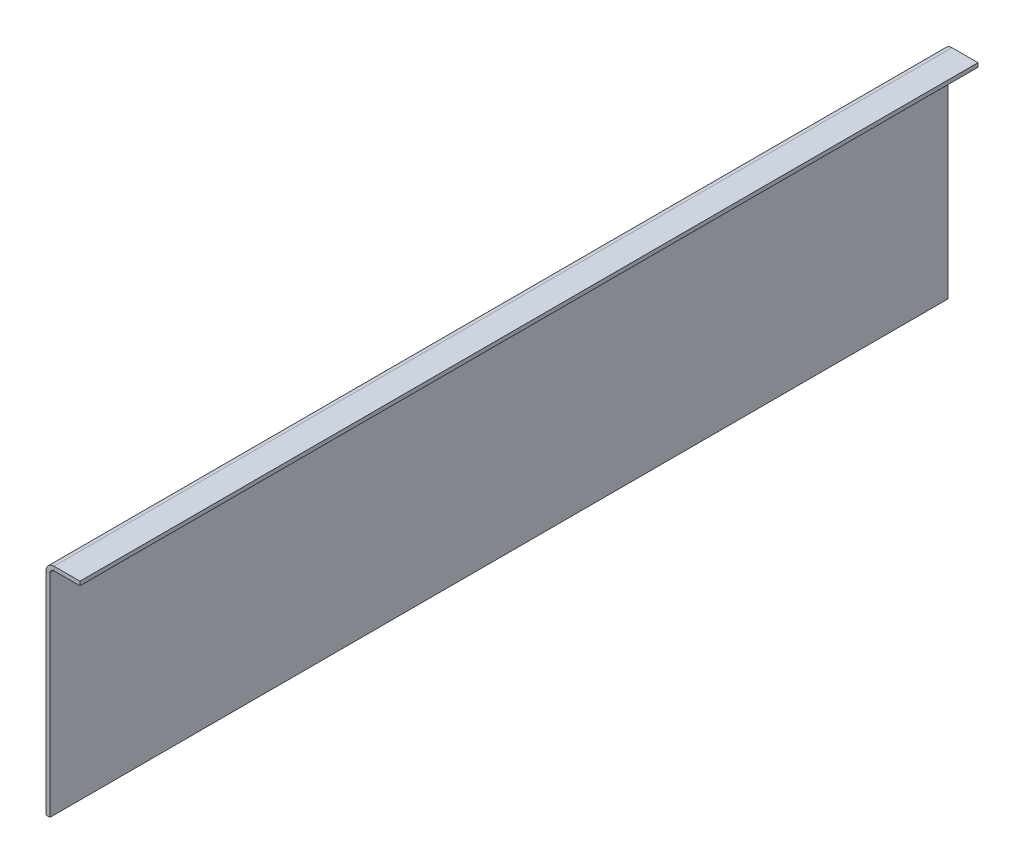
ISO-10303-21;
HEADER;
FILE_DESCRIPTION(('STEP AP214'),'2;1');
FILE_NAME('part.step','',(''),(''),'','','');
FILE_SCHEMA(('AUTOMOTIVE_DESIGN { 1 0 10303 214 1 1 1 1 }'));
ENDSEC;
DATA;
#1=APPLICATION_CONTEXT('core data for automotive mechanical design processes');
#2=APPLICATION_PROTOCOL_DEFINITION('international standard','automotive_design',2000,#1);
#3=PRODUCT_CONTEXT('',#1,'mechanical');
#4=PRODUCT('Part','Part','',(#3));
#5=PRODUCT_RELATED_PRODUCT_CATEGORY('part','',(#4));
#6=PRODUCT_DEFINITION_FORMATION('','',#4);
#7=PRODUCT_DEFINITION_CONTEXT('part definition',#1,'design');
#8=PRODUCT_DEFINITION('design','',#6,#7);
#9=PRODUCT_DEFINITION_SHAPE('','',#8);
#10=(LENGTH_UNIT() NAMED_UNIT(*) SI_UNIT(.MILLI.,.METRE.));
#11=(NAMED_UNIT(*) PLANE_ANGLE_UNIT() SI_UNIT($,.RADIAN.));
#12=(NAMED_UNIT(*) SI_UNIT($,.STERADIAN.) SOLID_ANGLE_UNIT());
#13=UNCERTAINTY_MEASURE_WITH_UNIT(LENGTH_MEASURE(1.E-05),#10,'distance_accuracy_value','');
#14=(GEOMETRIC_REPRESENTATION_CONTEXT(3) GLOBAL_UNCERTAINTY_ASSIGNED_CONTEXT((#13)) GLOBAL_UNIT_ASSIGNED_CONTEXT((#10,
#11,#12)) REPRESENTATION_CONTEXT('',''));
#15=CARTESIAN_POINT('',(0.,0.,0.));
#16=DIRECTION('',(0.,0.,1.));
#17=DIRECTION('',(1.,0.,0.));
#18=AXIS2_PLACEMENT_3D('',#15,#16,#17);
#19=CARTESIAN_POINT('',(17.,108.,-225.));
#20=DIRECTION('',(0.,0.,1.));
#21=DIRECTION('',(1.,0.,0.));
#22=AXIS2_PLACEMENT_3D('',#19,#20,#21);
#23=PLANE('',#22);
#24=DIRECTION('',(0.,-1.,0.));
#25=VECTOR('',#24,1.);
#26=CARTESIAN_POINT('',(3.99999999999998,108.,-225.));
#27=LINE('',#26,#25);
#28=CARTESIAN_POINT('',(3.99999999999998,110.,-225.));
#29=VERTEX_POINT('',#28);
#30=CARTESIAN_POINT('',(3.99999999999998,108.,-225.));
#31=VERTEX_POINT('',#30);
#32=EDGE_CURVE('E11',#29,#31,#27,.T.);
#33=ORIENTED_EDGE('',*,*,#32,.F.);
#34=DIRECTION('',(-1.,0.,0.));
#35=VECTOR('',#34,1.);
#36=CARTESIAN_POINT('',(17.,110.,-225.));
#37=LINE('',#36,#35);
#38=CARTESIAN_POINT('',(17.,110.,-225.));
#39=VERTEX_POINT('',#38);
#40=EDGE_CURVE('E93',#29,#39,#37,.F.);
#41=ORIENTED_EDGE('',*,*,#40,.T.);
#42=DIRECTION('',(0.,-1.,0.));
#43=VECTOR('',#42,1.);
#44=CARTESIAN_POINT('',(17.,108.,-225.));
#45=LINE('',#44,#43);
#46=CARTESIAN_POINT('',(17.,108.,-225.));
#47=VERTEX_POINT('',#46);
#48=EDGE_CURVE('E53',#39,#47,#45,.T.);
#49=ORIENTED_EDGE('',*,*,#48,.T.);
#50=DIRECTION('',(1.,0.,0.));
#51=VECTOR('',#50,1.);
#52=CARTESIAN_POINT('',(17.,108.,-225.));
#53=LINE('',#52,#51);
#54=EDGE_CURVE('E96',#31,#47,#53,.T.);
#55=ORIENTED_EDGE('',*,*,#54,.F.);
#56=EDGE_LOOP('',(#33,#41,#49,#55));
#57=FACE_BOUND('',#56,.T.);
#58=ADVANCED_FACE('F43',(#57),#23,.F.);
#59=CARTESIAN_POINT('',(17.,108.,225.));
#60=DIRECTION('',(1.,0.,0.));
#61=DIRECTION('',(0.,0.,-1.));
#62=AXIS2_PLACEMENT_3D('',#59,#60,#61);
#63=PLANE('',#62);
#64=ORIENTED_EDGE('',*,*,#48,.F.);
#65=DIRECTION('',(0.,0.,1.));
#66=VECTOR('',#65,1.);
#67=CARTESIAN_POINT('',(17.,110.,225.));
#68=LINE('',#67,#66);
#69=CARTESIAN_POINT('',(17.,110.,225.));
#70=VERTEX_POINT('',#69);
#71=EDGE_CURVE('E121',#70,#39,#68,.F.);
#72=ORIENTED_EDGE('',*,*,#71,.F.);
#73=DIRECTION('',(0.,-1.,0.));
#74=VECTOR('',#73,1.);
#75=CARTESIAN_POINT('',(17.,108.,225.));
#76=LINE('',#75,#74);
#77=CARTESIAN_POINT('',(17.,108.,225.));
#78=VERTEX_POINT('',#77);
#79=EDGE_CURVE('E139',#70,#78,#76,.T.);
#80=ORIENTED_EDGE('',*,*,#79,.T.);
#81=DIRECTION('',(0.,0.,-1.));
#82=VECTOR('',#81,1.);
#83=CARTESIAN_POINT('',(17.,108.,225.));
#84=LINE('',#83,#82);
#85=EDGE_CURVE('E150',#78,#47,#84,.T.);
#86=ORIENTED_EDGE('',*,*,#85,.T.);
#87=EDGE_LOOP('',(#64,#72,#80,#86));
#88=FACE_BOUND('',#87,.T.);
#89=ADVANCED_FACE('F156',(#88),#63,.T.);
#90=CARTESIAN_POINT('',(17.,108.,225.));
#91=DIRECTION('',(0.,0.,1.));
#92=DIRECTION('',(1.,0.,0.));
#93=AXIS2_PLACEMENT_3D('',#90,#91,#92);
#94=PLANE('',#93);
#95=ORIENTED_EDGE('',*,*,#79,.F.);
#96=DIRECTION('',(-1.,0.,0.));
#97=VECTOR('',#96,1.);
#98=CARTESIAN_POINT('',(17.,110.,225.));
#99=LINE('',#98,#97);
#100=CARTESIAN_POINT('',(3.99999999999998,110.,225.));
#101=VERTEX_POINT('',#100);
#102=EDGE_CURVE('E181',#101,#70,#99,.F.);
#103=ORIENTED_EDGE('',*,*,#102,.F.);
#104=DIRECTION('',(0.,-1.,0.));
#105=VECTOR('',#104,1.);
#106=CARTESIAN_POINT('',(3.99999999999998,108.,225.));
#107=LINE('',#106,#105);
#108=CARTESIAN_POINT('',(3.99999999999998,108.,225.));
#109=VERTEX_POINT('',#108);
#110=EDGE_CURVE('E136',#101,#109,#107,.T.);
#111=ORIENTED_EDGE('',*,*,#110,.T.);
#112=DIRECTION('',(1.,0.,0.));
#113=VECTOR('',#112,1.);
#114=CARTESIAN_POINT('',(17.,108.,225.));
#115=LINE('',#114,#113);
#116=EDGE_CURVE('E157',#109,#78,#115,.T.);
#117=ORIENTED_EDGE('',*,*,#116,.T.);
#118=EDGE_LOOP('',(#95,#103,#111,#117));
#119=FACE_BOUND('',#118,.T.);
#120=ADVANCED_FACE('F187',(#119),#94,.T.);
#121=CARTESIAN_POINT('',(3.99999999999999,106.,225.));
#122=DIRECTION('',(0.,0.,1.));
#123=DIRECTION('',(1.,0.,0.));
#124=AXIS2_PLACEMENT_3D('',#121,#122,#123);
#125=PLANE('',#124);
#126=ORIENTED_EDGE('',*,*,#110,.F.);
#127=CARTESIAN_POINT('',(3.99999999999999,106.,225.));
#128=DIRECTION('',(0.,0.,1.));
#129=DIRECTION('',(1.,0.,0.));
#130=AXIS2_PLACEMENT_3D('',#127,#128,#129);
#131=CIRCLE('',#130,4.);
#132=CARTESIAN_POINT('',(0.,106.,225.));
#133=VERTEX_POINT('',#132);
#134=EDGE_CURVE('E111',#101,#133,#131,.T.);
#135=ORIENTED_EDGE('',*,*,#134,.T.);
#136=DIRECTION('',(1.,0.,0.));
#137=VECTOR('',#136,1.);
#138=CARTESIAN_POINT('',(1.99999999999999,106.,225.));
#139=LINE('',#138,#137);
#140=CARTESIAN_POINT('',(1.99999999999999,106.,225.));
#141=VERTEX_POINT('',#140);
#142=EDGE_CURVE('E61',#133,#141,#139,.T.);
#143=ORIENTED_EDGE('',*,*,#142,.T.);
#144=CARTESIAN_POINT('',(3.99999999999999,106.,225.));
#145=DIRECTION('',(0.,0.,-1.));
#146=DIRECTION('',(-1.,0.,0.));
#147=AXIS2_PLACEMENT_3D('',#144,#145,#146);
#148=CIRCLE('',#147,2.);
#149=EDGE_CURVE('E154',#109,#141,#148,.F.);
#150=ORIENTED_EDGE('',*,*,#149,.F.);
#151=EDGE_LOOP('',(#126,#135,#143,#150));
#152=FACE_BOUND('',#151,.T.);
#153=ADVANCED_FACE('F190',(#152),#125,.T.);
#154=CARTESIAN_POINT('',(1.99999999999999,108.,225.));
#155=DIRECTION('',(0.,0.,1.));
#156=DIRECTION('',(0.,1.,0.));
#157=AXIS2_PLACEMENT_3D('',#154,#155,#156);
#158=PLANE('',#157);
#159=ORIENTED_EDGE('',*,*,#142,.F.);
#160=DIRECTION('',(0.,-1.,0.));
#161=VECTOR('',#160,1.);
#162=CARTESIAN_POINT('',(0.,108.,225.));
#163=LINE('',#162,#161);
#164=CARTESIAN_POINT('',(0.,0.,225.));
#165=VERTEX_POINT('',#164);
#166=EDGE_CURVE('E180',#165,#133,#163,.F.);
#167=ORIENTED_EDGE('',*,*,#166,.F.);
#168=DIRECTION('',(1.,0.,0.));
#169=VECTOR('',#168,1.);
#170=CARTESIAN_POINT('',(1.99999999999991,0.,225.));
#171=LINE('',#170,#169);
#172=CARTESIAN_POINT('',(1.99999999999991,0.,225.));
#173=VERTEX_POINT('',#172);
#174=EDGE_CURVE('E132',#165,#173,#171,.T.);
#175=ORIENTED_EDGE('',*,*,#174,.T.);
#176=DIRECTION('',(0.,1.,0.));
#177=VECTOR('',#176,1.);
#178=CARTESIAN_POINT('',(1.99999999999999,108.,225.));
#179=LINE('',#178,#177);
#180=EDGE_CURVE('E164',#173,#141,#179,.T.);
#181=ORIENTED_EDGE('',*,*,#180,.T.);
#182=EDGE_LOOP('',(#159,#167,#175,#181));
#183=FACE_BOUND('',#182,.T.);
#184=ADVANCED_FACE('F201',(#183),#158,.T.);
#185=CARTESIAN_POINT('',(1.99999999999991,0.,225.));
#186=DIRECTION('',(0.,1.,0.));
#187=DIRECTION('',(0.,0.,-1.));
#188=AXIS2_PLACEMENT_3D('',#185,#186,#187);
#189=PLANE('',#188);
#190=ORIENTED_EDGE('',*,*,#174,.F.);
#191=DIRECTION('',(0.,0.,1.));
#192=VECTOR('',#191,1.);
#193=CARTESIAN_POINT('',(0.,0.,225.));
#194=LINE('',#193,#192);
#195=CARTESIAN_POINT('',(0.,0.,-225.));
#196=VERTEX_POINT('',#195);
#197=EDGE_CURVE('E116',#165,#196,#194,.F.);
#198=ORIENTED_EDGE('',*,*,#197,.T.);
#199=DIRECTION('',(1.,0.,0.));
#200=VECTOR('',#199,1.);
#201=CARTESIAN_POINT('',(1.99999999999991,0.,-225.));
#202=LINE('',#201,#200);
#203=CARTESIAN_POINT('',(1.99999999999991,0.,-225.));
#204=VERTEX_POINT('',#203);
#205=EDGE_CURVE('E129',#196,#204,#202,.T.);
#206=ORIENTED_EDGE('',*,*,#205,.T.);
#207=DIRECTION('',(0.,0.,-1.));
#208=VECTOR('',#207,1.);
#209=CARTESIAN_POINT('',(1.99999999999991,0.,225.));
#210=LINE('',#209,#208);
#211=EDGE_CURVE('E167',#173,#204,#210,.T.);
#212=ORIENTED_EDGE('',*,*,#211,.F.);
#213=EDGE_LOOP('',(#190,#198,#206,#212));
#214=FACE_BOUND('',#213,.T.);
#215=ADVANCED_FACE('F207',(#214),#189,.F.);
#216=CARTESIAN_POINT('',(1.99999999999999,108.,-225.));
#217=DIRECTION('',(0.,0.,1.));
#218=DIRECTION('',(0.,1.,0.));
#219=AXIS2_PLACEMENT_3D('',#216,#217,#218);
#220=PLANE('',#219);
#221=ORIENTED_EDGE('',*,*,#205,.F.);
#222=DIRECTION('',(0.,-1.,0.));
#223=VECTOR('',#222,1.);
#224=CARTESIAN_POINT('',(0.,108.,-225.));
#225=LINE('',#224,#223);
#226=CARTESIAN_POINT('',(0.,106.,-225.));
#227=VERTEX_POINT('',#226);
#228=EDGE_CURVE('E178',#196,#227,#225,.F.);
#229=ORIENTED_EDGE('',*,*,#228,.T.);
#230=DIRECTION('',(1.,0.,0.));
#231=VECTOR('',#230,1.);
#232=CARTESIAN_POINT('',(1.99999999999999,106.,-225.));
#233=LINE('',#232,#231);
#234=CARTESIAN_POINT('',(1.99999999999999,106.,-225.));
#235=VERTEX_POINT('',#234);
#236=EDGE_CURVE('E47',#227,#235,#233,.T.);
#237=ORIENTED_EDGE('',*,*,#236,.T.);
#238=DIRECTION('',(0.,1.,0.));
#239=VECTOR('',#238,1.);
#240=CARTESIAN_POINT('',(1.99999999999999,108.,-225.));
#241=LINE('',#240,#239);
#242=EDGE_CURVE('E159',#204,#235,#241,.T.);
#243=ORIENTED_EDGE('',*,*,#242,.F.);
#244=EDGE_LOOP('',(#221,#229,#237,#243));
#245=FACE_BOUND('',#244,.T.);
#246=ADVANCED_FACE('F211',(#245),#220,.F.);
#247=CARTESIAN_POINT('',(3.99999999999999,106.,-225.));
#248=DIRECTION('',(0.,0.,-1.));
#249=DIRECTION('',(-1.,0.,0.));
#250=AXIS2_PLACEMENT_3D('',#247,#248,#249);
#251=PLANE('',#250);
#252=CARTESIAN_POINT('',(3.99999999999999,106.,-225.));
#253=DIRECTION('',(0.,0.,1.));
#254=DIRECTION('',(1.,0.,0.));
#255=AXIS2_PLACEMENT_3D('',#252,#253,#254);
#256=CIRCLE('',#255,4.);
#257=EDGE_CURVE('E109',#227,#29,#256,.F.);
#258=ORIENTED_EDGE('',*,*,#257,.T.);
#259=ORIENTED_EDGE('',*,*,#32,.T.);
#260=CARTESIAN_POINT('',(3.99999999999999,106.,-225.));
#261=DIRECTION('',(0.,0.,1.));
#262=DIRECTION('',(1.,0.,0.));
#263=AXIS2_PLACEMENT_3D('',#260,#261,#262);
#264=CIRCLE('',#263,2.);
#265=EDGE_CURVE('E174',#235,#31,#264,.F.);
#266=ORIENTED_EDGE('',*,*,#265,.F.);
#267=ORIENTED_EDGE('',*,*,#236,.F.);
#268=EDGE_LOOP('',(#258,#259,#266,#267));
#269=FACE_BOUND('',#268,.T.);
#270=ADVANCED_FACE('F45',(#269),#251,.T.);
#271=CARTESIAN_POINT('',(1.99999999999999,108.,225.));
#272=DIRECTION('',(-1.,0.,0.));
#273=DIRECTION('',(0.,-1.,0.));
#274=AXIS2_PLACEMENT_3D('',#271,#272,#273);
#275=PLANE('',#274);
#276=ORIENTED_EDGE('',*,*,#242,.T.);
#277=DIRECTION('',(0.,0.,-1.));
#278=VECTOR('',#277,1.);
#279=CARTESIAN_POINT('',(1.99999999999999,106.,225.));
#280=LINE('',#279,#278);
#281=EDGE_CURVE('E171',#235,#141,#280,.F.);
#282=ORIENTED_EDGE('',*,*,#281,.T.);
#283=ORIENTED_EDGE('',*,*,#180,.F.);
#284=ORIENTED_EDGE('',*,*,#211,.T.);
#285=EDGE_LOOP('',(#276,#282,#283,#284));
#286=FACE_BOUND('',#285,.T.);
#287=ADVANCED_FACE('F206',(#286),#275,.F.);
#288=CARTESIAN_POINT('',(17.,108.,225.));
#289=DIRECTION('',(0.,1.,0.));
#290=DIRECTION('',(-1.,0.,0.));
#291=AXIS2_PLACEMENT_3D('',#288,#289,#290);
#292=PLANE('',#291);
#293=ORIENTED_EDGE('',*,*,#116,.F.);
#294=DIRECTION('',(0.,0.,-1.));
#295=VECTOR('',#294,1.);
#296=CARTESIAN_POINT('',(3.99999999999998,108.,-225.));
#297=LINE('',#296,#295);
#298=EDGE_CURVE('E153',#109,#31,#297,.T.);
#299=ORIENTED_EDGE('',*,*,#298,.T.);
#300=ORIENTED_EDGE('',*,*,#54,.T.);
#301=ORIENTED_EDGE('',*,*,#85,.F.);
#302=EDGE_LOOP('',(#293,#299,#300,#301));
#303=FACE_BOUND('',#302,.T.);
#304=ADVANCED_FACE('F149',(#303),#292,.F.);
#305=CARTESIAN_POINT('',(3.99999999999999,106.,225.));
#306=DIRECTION('',(0.,0.,1.));
#307=DIRECTION('',(1.,0.,0.));
#308=AXIS2_PLACEMENT_3D('',#305,#306,#307);
#309=CYLINDRICAL_SURFACE('',#308,2.);
#310=ORIENTED_EDGE('',*,*,#149,.T.);
#311=ORIENTED_EDGE('',*,*,#281,.F.);
#312=ORIENTED_EDGE('',*,*,#265,.T.);
#313=ORIENTED_EDGE('',*,*,#298,.F.);
#314=EDGE_LOOP('',(#310,#311,#312,#313));
#315=FACE_BOUND('',#314,.T.);
#316=ADVANCED_FACE('F193',(#315),#309,.F.);
#317=CARTESIAN_POINT('',(0.,108.,225.));
#318=DIRECTION('',(-1.,0.,0.));
#319=DIRECTION('',(0.,-1.,0.));
#320=AXIS2_PLACEMENT_3D('',#317,#318,#319);
#321=PLANE('',#320);
#322=ORIENTED_EDGE('',*,*,#228,.F.);
#323=ORIENTED_EDGE('',*,*,#197,.F.);
#324=ORIENTED_EDGE('',*,*,#166,.T.);
#325=DIRECTION('',(0.,0.,1.));
#326=VECTOR('',#325,1.);
#327=CARTESIAN_POINT('',(0.,106.,225.));
#328=LINE('',#327,#326);
#329=EDGE_CURVE('E115',#227,#133,#328,.T.);
#330=ORIENTED_EDGE('',*,*,#329,.F.);
#331=EDGE_LOOP('',(#322,#323,#324,#330));
#332=FACE_BOUND('',#331,.T.);
#333=ADVANCED_FACE('F213',(#332),#321,.T.);
#334=CARTESIAN_POINT('',(17.,110.,225.));
#335=DIRECTION('',(0.,1.,0.));
#336=DIRECTION('',(-1.,0.,0.));
#337=AXIS2_PLACEMENT_3D('',#334,#335,#336);
#338=PLANE('',#337);
#339=ORIENTED_EDGE('',*,*,#102,.T.);
#340=ORIENTED_EDGE('',*,*,#71,.T.);
#341=ORIENTED_EDGE('',*,*,#40,.F.);
#342=DIRECTION('',(0.,0.,1.));
#343=VECTOR('',#342,1.);
#344=CARTESIAN_POINT('',(3.99999999999998,110.,225.));
#345=LINE('',#344,#343);
#346=EDGE_CURVE('E106',#101,#29,#345,.F.);
#347=ORIENTED_EDGE('',*,*,#346,.F.);
#348=EDGE_LOOP('',(#339,#340,#341,#347));
#349=FACE_BOUND('',#348,.T.);
#350=ADVANCED_FACE('F119',(#349),#338,.T.);
#351=CARTESIAN_POINT('',(3.99999999999999,106.,225.));
#352=DIRECTION('',(0.,0.,1.));
#353=DIRECTION('',(1.,0.,0.));
#354=AXIS2_PLACEMENT_3D('',#351,#352,#353);
#355=CYLINDRICAL_SURFACE('',#354,4.);
#356=ORIENTED_EDGE('',*,*,#134,.F.);
#357=ORIENTED_EDGE('',*,*,#346,.T.);
#358=ORIENTED_EDGE('',*,*,#257,.F.);
#359=ORIENTED_EDGE('',*,*,#329,.T.);
#360=EDGE_LOOP('',(#356,#357,#358,#359));
#361=FACE_BOUND('',#360,.T.);
#362=ADVANCED_FACE('F107',(#361),#355,.T.);
#363=CLOSED_SHELL('',(#58,#89,#120,#153,#184,#215,#246,#270,#287,#304,#316,#333,#350,#362));
#364=MANIFOLD_SOLID_BREP('B2',#363);
#365=ADVANCED_BREP_SHAPE_REPRESENTATION('',(#18,#364),#14);
#366=SHAPE_DEFINITION_REPRESENTATION(#9,#365);
ENDSEC;
END-ISO-10303-21;
